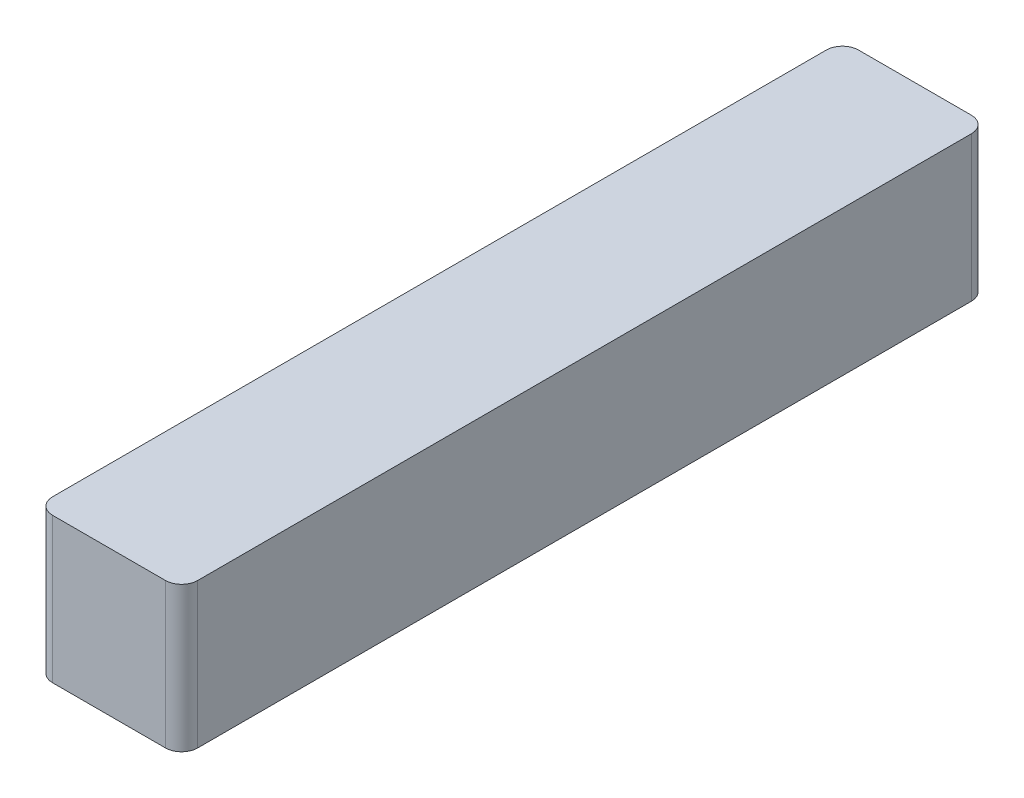
ISO-10303-21;
HEADER;
FILE_DESCRIPTION(('STEP AP214'),'2;1');
FILE_NAME('part.step','',(''),(''),'','','');
FILE_SCHEMA(('AUTOMOTIVE_DESIGN { 1 0 10303 214 1 1 1 1 }'));
ENDSEC;
DATA;
#1=APPLICATION_CONTEXT('core data for automotive mechanical design processes');
#2=APPLICATION_PROTOCOL_DEFINITION('international standard','automotive_design',2000,#1);
#3=PRODUCT_CONTEXT('',#1,'mechanical');
#4=PRODUCT('Part','Part','',(#3));
#5=PRODUCT_RELATED_PRODUCT_CATEGORY('part','',(#4));
#6=PRODUCT_DEFINITION_FORMATION('','',#4);
#7=PRODUCT_DEFINITION_CONTEXT('part definition',#1,'design');
#8=PRODUCT_DEFINITION('design','',#6,#7);
#9=PRODUCT_DEFINITION_SHAPE('','',#8);
#10=(LENGTH_UNIT() NAMED_UNIT(*) SI_UNIT(.MILLI.,.METRE.));
#11=(NAMED_UNIT(*) PLANE_ANGLE_UNIT() SI_UNIT($,.RADIAN.));
#12=(NAMED_UNIT(*) SI_UNIT($,.STERADIAN.) SOLID_ANGLE_UNIT());
#13=UNCERTAINTY_MEASURE_WITH_UNIT(LENGTH_MEASURE(1.E-05),#10,'distance_accuracy_value','');
#14=(GEOMETRIC_REPRESENTATION_CONTEXT(3) GLOBAL_UNCERTAINTY_ASSIGNED_CONTEXT((#13)) GLOBAL_UNIT_ASSIGNED_CONTEXT((#10,
#11,#12)) REPRESENTATION_CONTEXT('',''));
#15=CARTESIAN_POINT('',(0.,0.,0.));
#16=DIRECTION('',(0.,0.,1.));
#17=DIRECTION('',(1.,0.,0.));
#18=AXIS2_PLACEMENT_3D('',#15,#16,#17);
#19=CARTESIAN_POINT('',(1.143,1.143,12.7));
#20=DIRECTION('',(-1.,0.,0.));
#21=DIRECTION('',(0.,-1.,0.));
#22=AXIS2_PLACEMENT_3D('',#19,#20,#21);
#23=PLANE('',#22);
#24=DIRECTION('',(0.,0.,-1.));
#25=VECTOR('',#24,1.);
#26=CARTESIAN_POINT('',(1.143,-1.143,12.7));
#27=LINE('',#26,#25);
#28=CARTESIAN_POINT('',(1.143,-1.143,12.446));
#29=VERTEX_POINT('',#28);
#30=CARTESIAN_POINT('',(1.143,-1.143,0.254000000000001));
#31=VERTEX_POINT('',#30);
#32=EDGE_CURVE('E121',#29,#31,#27,.T.);
#33=ORIENTED_EDGE('',*,*,#32,.T.);
#34=DIRECTION('',(0.,1.,0.));
#35=VECTOR('',#34,1.);
#36=CARTESIAN_POINT('',(1.143,1.143,0.254000000000001));
#37=LINE('',#36,#35);
#38=CARTESIAN_POINT('',(1.143,1.143,0.254000000000001));
#39=VERTEX_POINT('',#38);
#40=EDGE_CURVE('E147',#31,#39,#37,.T.);
#41=ORIENTED_EDGE('',*,*,#40,.T.);
#42=DIRECTION('',(0.,0.,-1.));
#43=VECTOR('',#42,1.);
#44=CARTESIAN_POINT('',(1.143,1.143,12.7));
#45=LINE('',#44,#43);
#46=CARTESIAN_POINT('',(1.143,1.143,12.446));
#47=VERTEX_POINT('',#46);
#48=EDGE_CURVE('E126',#47,#39,#45,.T.);
#49=ORIENTED_EDGE('',*,*,#48,.F.);
#50=DIRECTION('',(0.,1.,0.));
#51=VECTOR('',#50,1.);
#52=CARTESIAN_POINT('',(1.143,-1.143,12.446));
#53=LINE('',#52,#51);
#54=EDGE_CURVE('E145',#47,#29,#53,.F.);
#55=ORIENTED_EDGE('',*,*,#54,.T.);
#56=EDGE_LOOP('',(#33,#41,#49,#55));
#57=FACE_BOUND('',#56,.T.);
#58=ADVANCED_FACE('F33',(#57),#23,.F.);
#59=CARTESIAN_POINT('',(-1.143,1.143,12.7));
#60=DIRECTION('',(0.,-1.,0.));
#61=DIRECTION('',(0.,0.,-1.));
#62=AXIS2_PLACEMENT_3D('',#59,#60,#61);
#63=PLANE('',#62);
#64=DIRECTION('',(-1.,0.,0.));
#65=VECTOR('',#64,1.);
#66=CARTESIAN_POINT('',(-1.143,1.143,0.));
#67=LINE('',#66,#65);
#68=CARTESIAN_POINT('',(0.889,1.143,0.));
#69=VERTEX_POINT('',#68);
#70=CARTESIAN_POINT('',(-0.889,1.143,0.));
#71=VERTEX_POINT('',#70);
#72=EDGE_CURVE('E162',#69,#71,#67,.T.);
#73=ORIENTED_EDGE('',*,*,#72,.T.);
#74=CARTESIAN_POINT('',(-0.889,1.143,0.254000000000001));
#75=DIRECTION('',(0.,-1.,0.));
#76=DIRECTION('',(0.,0.,-1.));
#77=AXIS2_PLACEMENT_3D('',#74,#75,#76);
#78=CIRCLE('',#77,0.254);
#79=CARTESIAN_POINT('',(-1.143,1.143,0.254000000000001));
#80=VERTEX_POINT('',#79);
#81=EDGE_CURVE('E143',#71,#80,#78,.F.);
#82=ORIENTED_EDGE('',*,*,#81,.T.);
#83=DIRECTION('',(0.,0.,-1.));
#84=VECTOR('',#83,1.);
#85=CARTESIAN_POINT('',(-1.143,1.143,12.7));
#86=LINE('',#85,#84);
#87=CARTESIAN_POINT('',(-1.143,1.143,12.446));
#88=VERTEX_POINT('',#87);
#89=EDGE_CURVE('E120',#88,#80,#86,.T.);
#90=ORIENTED_EDGE('',*,*,#89,.F.);
#91=CARTESIAN_POINT('',(-0.889,1.143,12.446));
#92=DIRECTION('',(0.,-1.,0.));
#93=DIRECTION('',(0.,0.,-1.));
#94=AXIS2_PLACEMENT_3D('',#91,#92,#93);
#95=CIRCLE('',#94,0.254);
#96=CARTESIAN_POINT('',(-0.889,1.143,12.7));
#97=VERTEX_POINT('',#96);
#98=EDGE_CURVE('E125',#88,#97,#95,.F.);
#99=ORIENTED_EDGE('',*,*,#98,.T.);
#100=DIRECTION('',(-1.,0.,0.));
#101=VECTOR('',#100,1.);
#102=CARTESIAN_POINT('',(-1.143,1.143,12.7));
#103=LINE('',#102,#101);
#104=CARTESIAN_POINT('',(0.889,1.143,12.7));
#105=VERTEX_POINT('',#104);
#106=EDGE_CURVE('E153',#105,#97,#103,.T.);
#107=ORIENTED_EDGE('',*,*,#106,.F.);
#108=CARTESIAN_POINT('',(0.889,1.143,12.446));
#109=DIRECTION('',(0.,-1.,0.));
#110=DIRECTION('',(0.,0.,-1.));
#111=AXIS2_PLACEMENT_3D('',#108,#109,#110);
#112=CIRCLE('',#111,0.254);
#113=EDGE_CURVE('E56',#105,#47,#112,.F.);
#114=ORIENTED_EDGE('',*,*,#113,.T.);
#115=ORIENTED_EDGE('',*,*,#48,.T.);
#116=CARTESIAN_POINT('',(0.889,1.143,0.254000000000001));
#117=DIRECTION('',(0.,-1.,0.));
#118=DIRECTION('',(0.,0.,-1.));
#119=AXIS2_PLACEMENT_3D('',#116,#117,#118);
#120=CIRCLE('',#119,0.254);
#121=EDGE_CURVE('E48',#39,#69,#120,.F.);
#122=ORIENTED_EDGE('',*,*,#121,.T.);
#123=EDGE_LOOP('',(#73,#82,#90,#99,#107,#114,#115,#122));
#124=FACE_BOUND('',#123,.T.);
#125=ADVANCED_FACE('F157',(#124),#63,.F.);
#126=CARTESIAN_POINT('',(-1.143,1.143,12.7));
#127=DIRECTION('',(1.,0.,0.));
#128=DIRECTION('',(0.,1.,0.));
#129=AXIS2_PLACEMENT_3D('',#126,#127,#128);
#130=PLANE('',#129);
#131=ORIENTED_EDGE('',*,*,#89,.T.);
#132=DIRECTION('',(0.,-1.,0.));
#133=VECTOR('',#132,1.);
#134=CARTESIAN_POINT('',(-1.143,1.143,0.254000000000001));
#135=LINE('',#134,#133);
#136=CARTESIAN_POINT('',(-1.143,-1.143,0.254000000000001));
#137=VERTEX_POINT('',#136);
#138=EDGE_CURVE('E119',#80,#137,#135,.T.);
#139=ORIENTED_EDGE('',*,*,#138,.T.);
#140=DIRECTION('',(0.,0.,-1.));
#141=VECTOR('',#140,1.);
#142=CARTESIAN_POINT('',(-1.143,-1.143,12.7));
#143=LINE('',#142,#141);
#144=CARTESIAN_POINT('',(-1.143,-1.143,12.446));
#145=VERTEX_POINT('',#144);
#146=EDGE_CURVE('E103',#145,#137,#143,.T.);
#147=ORIENTED_EDGE('',*,*,#146,.F.);
#148=DIRECTION('',(0.,-1.,0.));
#149=VECTOR('',#148,1.);
#150=CARTESIAN_POINT('',(-1.143,1.143,12.446));
#151=LINE('',#150,#149);
#152=EDGE_CURVE('E116',#145,#88,#151,.F.);
#153=ORIENTED_EDGE('',*,*,#152,.T.);
#154=EDGE_LOOP('',(#131,#139,#147,#153));
#155=FACE_BOUND('',#154,.T.);
#156=ADVANCED_FACE('F115',(#155),#130,.F.);
#157=CARTESIAN_POINT('',(-1.143,-1.143,12.7));
#158=DIRECTION('',(0.,1.,0.));
#159=DIRECTION('',(0.,0.,1.));
#160=AXIS2_PLACEMENT_3D('',#157,#158,#159);
#161=PLANE('',#160);
#162=ORIENTED_EDGE('',*,*,#146,.T.);
#163=CARTESIAN_POINT('',(-0.889,-1.143,0.254000000000001));
#164=DIRECTION('',(0.,1.,0.));
#165=DIRECTION('',(0.,0.,1.));
#166=AXIS2_PLACEMENT_3D('',#163,#164,#165);
#167=CIRCLE('',#166,0.254);
#168=CARTESIAN_POINT('',(-0.889,-1.143,0.));
#169=VERTEX_POINT('',#168);
#170=EDGE_CURVE('E134',#137,#169,#167,.F.);
#171=ORIENTED_EDGE('',*,*,#170,.T.);
#172=DIRECTION('',(1.,0.,0.));
#173=VECTOR('',#172,1.);
#174=CARTESIAN_POINT('',(-1.143,-1.143,0.));
#175=LINE('',#174,#173);
#176=CARTESIAN_POINT('',(0.889,-1.143,0.));
#177=VERTEX_POINT('',#176);
#178=EDGE_CURVE('E158',#169,#177,#175,.T.);
#179=ORIENTED_EDGE('',*,*,#178,.T.);
#180=CARTESIAN_POINT('',(0.889,-1.143,0.254000000000001));
#181=DIRECTION('',(0.,1.,0.));
#182=DIRECTION('',(0.,0.,1.));
#183=AXIS2_PLACEMENT_3D('',#180,#181,#182);
#184=CIRCLE('',#183,0.254);
#185=EDGE_CURVE('E109',#177,#31,#184,.F.);
#186=ORIENTED_EDGE('',*,*,#185,.T.);
#187=ORIENTED_EDGE('',*,*,#32,.F.);
#188=CARTESIAN_POINT('',(0.889,-1.143,12.446));
#189=DIRECTION('',(0.,1.,0.));
#190=DIRECTION('',(0.,0.,1.));
#191=AXIS2_PLACEMENT_3D('',#188,#189,#190);
#192=CIRCLE('',#191,0.254);
#193=CARTESIAN_POINT('',(0.889,-1.143,12.7));
#194=VERTEX_POINT('',#193);
#195=EDGE_CURVE('E110',#29,#194,#192,.F.);
#196=ORIENTED_EDGE('',*,*,#195,.T.);
#197=DIRECTION('',(1.,0.,0.));
#198=VECTOR('',#197,1.);
#199=CARTESIAN_POINT('',(-1.143,-1.143,12.7));
#200=LINE('',#199,#198);
#201=CARTESIAN_POINT('',(-0.889,-1.143,12.7));
#202=VERTEX_POINT('',#201);
#203=EDGE_CURVE('E105',#202,#194,#200,.T.);
#204=ORIENTED_EDGE('',*,*,#203,.F.);
#205=CARTESIAN_POINT('',(-0.889,-1.143,12.446));
#206=DIRECTION('',(0.,1.,0.));
#207=DIRECTION('',(0.,0.,1.));
#208=AXIS2_PLACEMENT_3D('',#205,#206,#207);
#209=CIRCLE('',#208,0.254);
#210=EDGE_CURVE('E100',#202,#145,#209,.F.);
#211=ORIENTED_EDGE('',*,*,#210,.T.);
#212=EDGE_LOOP('',(#162,#171,#179,#186,#187,#196,#204,#211));
#213=FACE_BOUND('',#212,.T.);
#214=ADVANCED_FACE('F102',(#213),#161,.F.);
#215=CARTESIAN_POINT('',(0.,0.,12.7));
#216=DIRECTION('',(0.,0.,1.));
#217=DIRECTION('',(1.,0.,0.));
#218=AXIS2_PLACEMENT_3D('',#215,#216,#217);
#219=PLANE('',#218);
#220=ORIENTED_EDGE('',*,*,#106,.T.);
#221=DIRECTION('',(0.,-1.,0.));
#222=VECTOR('',#221,1.);
#223=CARTESIAN_POINT('',(-0.889,-1.143,12.7));
#224=LINE('',#223,#222);
#225=EDGE_CURVE('E11',#97,#202,#224,.T.);
#226=ORIENTED_EDGE('',*,*,#225,.T.);
#227=ORIENTED_EDGE('',*,*,#203,.T.);
#228=DIRECTION('',(0.,1.,0.));
#229=VECTOR('',#228,1.);
#230=CARTESIAN_POINT('',(0.889,1.143,12.7));
#231=LINE('',#230,#229);
#232=EDGE_CURVE('E41',#194,#105,#231,.T.);
#233=ORIENTED_EDGE('',*,*,#232,.T.);
#234=EDGE_LOOP('',(#220,#226,#227,#233));
#235=FACE_BOUND('',#234,.T.);
#236=ADVANCED_FACE('F152',(#235),#219,.T.);
#237=CARTESIAN_POINT('',(0.,0.,0.));
#238=DIRECTION('',(0.,0.,1.));
#239=DIRECTION('',(1.,0.,0.));
#240=AXIS2_PLACEMENT_3D('',#237,#238,#239);
#241=PLANE('',#240);
#242=ORIENTED_EDGE('',*,*,#178,.F.);
#243=DIRECTION('',(0.,-1.,0.));
#244=VECTOR('',#243,1.);
#245=CARTESIAN_POINT('',(-0.889,0.,0.));
#246=LINE('',#245,#244);
#247=EDGE_CURVE('E138',#169,#71,#246,.F.);
#248=ORIENTED_EDGE('',*,*,#247,.T.);
#249=ORIENTED_EDGE('',*,*,#72,.F.);
#250=DIRECTION('',(0.,1.,0.));
#251=VECTOR('',#250,1.);
#252=CARTESIAN_POINT('',(0.889,0.,0.));
#253=LINE('',#252,#251);
#254=EDGE_CURVE('E136',#69,#177,#253,.F.);
#255=ORIENTED_EDGE('',*,*,#254,.T.);
#256=EDGE_LOOP('',(#242,#248,#249,#255));
#257=FACE_BOUND('',#256,.T.);
#258=ADVANCED_FACE('F174',(#257),#241,.F.);
#259=CARTESIAN_POINT('',(-0.889,1.143,0.254000000000001));
#260=DIRECTION('',(0.,-1.,0.));
#261=DIRECTION('',(1.,0.,0.));
#262=AXIS2_PLACEMENT_3D('',#259,#260,#261);
#263=CYLINDRICAL_SURFACE('',#262,0.254);
#264=ORIENTED_EDGE('',*,*,#81,.F.);
#265=ORIENTED_EDGE('',*,*,#247,.F.);
#266=ORIENTED_EDGE('',*,*,#170,.F.);
#267=ORIENTED_EDGE('',*,*,#138,.F.);
#268=EDGE_LOOP('',(#264,#265,#266,#267));
#269=FACE_BOUND('',#268,.T.);
#270=ADVANCED_FACE('F169',(#269),#263,.T.);
#271=CARTESIAN_POINT('',(0.889,1.143,0.254000000000001));
#272=DIRECTION('',(0.,1.,0.));
#273=DIRECTION('',(-1.,0.,0.));
#274=AXIS2_PLACEMENT_3D('',#271,#272,#273);
#275=CYLINDRICAL_SURFACE('',#274,0.254);
#276=ORIENTED_EDGE('',*,*,#185,.F.);
#277=ORIENTED_EDGE('',*,*,#254,.F.);
#278=ORIENTED_EDGE('',*,*,#121,.F.);
#279=ORIENTED_EDGE('',*,*,#40,.F.);
#280=EDGE_LOOP('',(#276,#277,#278,#279));
#281=FACE_BOUND('',#280,.T.);
#282=ADVANCED_FACE('F176',(#281),#275,.T.);
#283=CARTESIAN_POINT('',(-0.889,0.,12.446));
#284=DIRECTION('',(0.,1.,0.));
#285=DIRECTION('',(-1.,0.,0.));
#286=AXIS2_PLACEMENT_3D('',#283,#284,#285);
#287=CYLINDRICAL_SURFACE('',#286,0.254);
#288=ORIENTED_EDGE('',*,*,#98,.F.);
#289=ORIENTED_EDGE('',*,*,#152,.F.);
#290=ORIENTED_EDGE('',*,*,#210,.F.);
#291=ORIENTED_EDGE('',*,*,#225,.F.);
#292=EDGE_LOOP('',(#288,#289,#290,#291));
#293=FACE_BOUND('',#292,.T.);
#294=ADVANCED_FACE('F124',(#293),#287,.T.);
#295=CARTESIAN_POINT('',(0.889,0.,12.446));
#296=DIRECTION('',(0.,-1.,0.));
#297=DIRECTION('',(1.,0.,0.));
#298=AXIS2_PLACEMENT_3D('',#295,#296,#297);
#299=CYLINDRICAL_SURFACE('',#298,0.254);
#300=ORIENTED_EDGE('',*,*,#195,.F.);
#301=ORIENTED_EDGE('',*,*,#54,.F.);
#302=ORIENTED_EDGE('',*,*,#113,.F.);
#303=ORIENTED_EDGE('',*,*,#232,.F.);
#304=EDGE_LOOP('',(#300,#301,#302,#303));
#305=FACE_BOUND('',#304,.T.);
#306=ADVANCED_FACE('F35',(#305),#299,.T.);
#307=CLOSED_SHELL('',(#58,#125,#156,#214,#236,#258,#270,#282,#294,#306));
#308=MANIFOLD_SOLID_BREP('B2',#307);
#309=ADVANCED_BREP_SHAPE_REPRESENTATION('',(#18,#308),#14);
#310=SHAPE_DEFINITION_REPRESENTATION(#9,#309);
ENDSEC;
END-ISO-10303-21;
